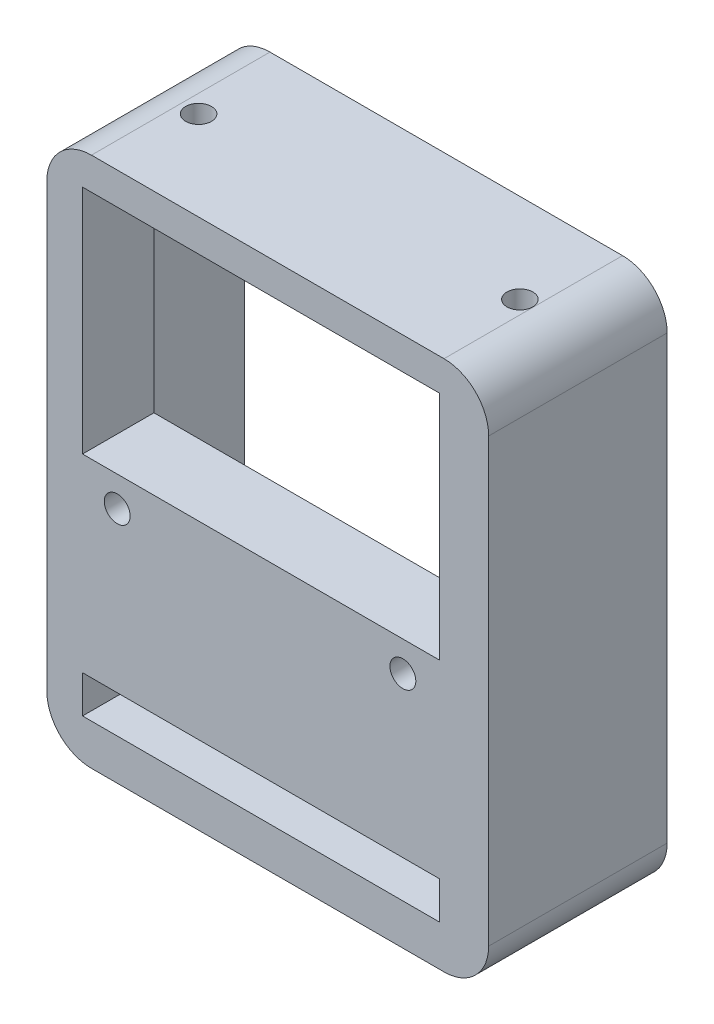
ISO-10303-21;
HEADER;
FILE_DESCRIPTION(('STEP AP214'),'2;1');
FILE_NAME('part.step','',(''),(''),'','','');
FILE_SCHEMA(('AUTOMOTIVE_DESIGN { 1 0 10303 214 1 1 1 1 }'));
ENDSEC;
DATA;
#1=APPLICATION_CONTEXT('core data for automotive mechanical design processes');
#2=APPLICATION_PROTOCOL_DEFINITION('international standard','automotive_design',2000,#1);
#3=PRODUCT_CONTEXT('',#1,'mechanical');
#4=PRODUCT('Part','Part','',(#3));
#5=PRODUCT_RELATED_PRODUCT_CATEGORY('part','',(#4));
#6=PRODUCT_DEFINITION_FORMATION('','',#4);
#7=PRODUCT_DEFINITION_CONTEXT('part definition',#1,'design');
#8=PRODUCT_DEFINITION('design','',#6,#7);
#9=PRODUCT_DEFINITION_SHAPE('','',#8);
#10=(LENGTH_UNIT() NAMED_UNIT(*) SI_UNIT(.MILLI.,.METRE.));
#11=(NAMED_UNIT(*) PLANE_ANGLE_UNIT() SI_UNIT($,.RADIAN.));
#12=(NAMED_UNIT(*) SI_UNIT($,.STERADIAN.) SOLID_ANGLE_UNIT());
#13=UNCERTAINTY_MEASURE_WITH_UNIT(LENGTH_MEASURE(1.E-05),#10,'distance_accuracy_value','');
#14=(GEOMETRIC_REPRESENTATION_CONTEXT(3) GLOBAL_UNCERTAINTY_ASSIGNED_CONTEXT((#13)) GLOBAL_UNIT_ASSIGNED_CONTEXT((#10,
#11,#12)) REPRESENTATION_CONTEXT('',''));
#15=CARTESIAN_POINT('',(0.,0.,0.));
#16=DIRECTION('',(0.,0.,1.));
#17=DIRECTION('',(1.,0.,0.));
#18=AXIS2_PLACEMENT_3D('',#15,#16,#17);
#19=CARTESIAN_POINT('',(19.75,-24.75,20.));
#20=DIRECTION('',(0.,0.,1.));
#21=DIRECTION('',(1.,0.,0.));
#22=AXIS2_PLACEMENT_3D('',#19,#20,#21);
#23=PLANE('',#22);
#24=CARTESIAN_POINT('',(-16.862,-3.116,20.));
#25=DIRECTION('',(0.,0.,-1.));
#26=DIRECTION('',(-1.,0.,0.));
#27=AXIS2_PLACEMENT_3D('',#24,#25,#26);
#28=CIRCLE('',#27,1.45);
#29=CARTESIAN_POINT('',(-18.312,-3.116,20.));
#30=VERTEX_POINT('',#29);
#31=EDGE_CURVE('E212',#30,#30,#28,.T.);
#32=ORIENTED_EDGE('',*,*,#31,.T.);
#33=EDGE_LOOP('',(#32));
#34=FACE_BOUND('',#33,.T.);
#35=CARTESIAN_POINT('',(15.138,-3.116,20.));
#36=DIRECTION('',(0.,0.,-1.));
#37=DIRECTION('',(-1.,0.,0.));
#38=AXIS2_PLACEMENT_3D('',#35,#36,#37);
#39=CIRCLE('',#38,1.45);
#40=CARTESIAN_POINT('',(13.688,-3.116,20.));
#41=VERTEX_POINT('',#40);
#42=EDGE_CURVE('E339',#41,#41,#39,.T.);
#43=ORIENTED_EDGE('',*,*,#42,.T.);
#44=EDGE_LOOP('',(#43));
#45=FACE_BOUND('',#44,.T.);
#46=CARTESIAN_POINT('',(19.75,-24.75,20.));
#47=DIRECTION('',(0.,0.,1.));
#48=DIRECTION('',(1.,0.,0.));
#49=AXIS2_PLACEMENT_3D('',#46,#47,#48);
#50=CIRCLE('',#49,4.99999999999999);
#51=CARTESIAN_POINT('',(19.75,-29.75,20.));
#52=VERTEX_POINT('',#51);
#53=CARTESIAN_POINT('',(24.75,-24.75,20.));
#54=VERTEX_POINT('',#53);
#55=EDGE_CURVE('E261',#52,#54,#50,.T.);
#56=ORIENTED_EDGE('',*,*,#55,.T.);
#57=DIRECTION('',(0.,1.,0.));
#58=VECTOR('',#57,1.);
#59=CARTESIAN_POINT('',(24.75,24.75,20.));
#60=LINE('',#59,#58);
#61=CARTESIAN_POINT('',(24.75,24.75,20.));
#62=VERTEX_POINT('',#61);
#63=EDGE_CURVE('E264',#54,#62,#60,.T.);
#64=ORIENTED_EDGE('',*,*,#63,.T.);
#65=CARTESIAN_POINT('',(19.75,24.75,20.));
#66=DIRECTION('',(0.,0.,1.));
#67=DIRECTION('',(-1.,0.,0.));
#68=AXIS2_PLACEMENT_3D('',#65,#66,#67);
#69=CIRCLE('',#68,4.99999999999999);
#70=CARTESIAN_POINT('',(19.75,29.75,20.));
#71=VERTEX_POINT('',#70);
#72=EDGE_CURVE('E267',#62,#71,#69,.T.);
#73=ORIENTED_EDGE('',*,*,#72,.T.);
#74=DIRECTION('',(-1.,0.,0.));
#75=VECTOR('',#74,1.);
#76=CARTESIAN_POINT('',(-19.75,29.75,20.));
#77=LINE('',#76,#75);
#78=CARTESIAN_POINT('',(-19.75,29.75,20.));
#79=VERTEX_POINT('',#78);
#80=EDGE_CURVE('E269',#71,#79,#77,.T.);
#81=ORIENTED_EDGE('',*,*,#80,.T.);
#82=CARTESIAN_POINT('',(-19.75,24.75,20.));
#83=DIRECTION('',(0.,0.,1.));
#84=DIRECTION('',(1.,0.,0.));
#85=AXIS2_PLACEMENT_3D('',#82,#83,#84);
#86=CIRCLE('',#85,4.99999999999999);
#87=CARTESIAN_POINT('',(-24.75,24.75,20.));
#88=VERTEX_POINT('',#87);
#89=EDGE_CURVE('E271',#79,#88,#86,.T.);
#90=ORIENTED_EDGE('',*,*,#89,.T.);
#91=DIRECTION('',(0.,-1.,0.));
#92=VECTOR('',#91,1.);
#93=CARTESIAN_POINT('',(-24.75,24.75,20.));
#94=LINE('',#93,#92);
#95=CARTESIAN_POINT('',(-24.75,-24.75,20.));
#96=VERTEX_POINT('',#95);
#97=EDGE_CURVE('E273',#88,#96,#94,.T.);
#98=ORIENTED_EDGE('',*,*,#97,.T.);
#99=CARTESIAN_POINT('',(-19.75,-24.75,20.));
#100=DIRECTION('',(0.,0.,1.));
#101=DIRECTION('',(1.,0.,0.));
#102=AXIS2_PLACEMENT_3D('',#99,#100,#101);
#103=CIRCLE('',#102,4.99999999999999);
#104=CARTESIAN_POINT('',(-19.75,-29.75,20.));
#105=VERTEX_POINT('',#104);
#106=EDGE_CURVE('E275',#96,#105,#103,.T.);
#107=ORIENTED_EDGE('',*,*,#106,.T.);
#108=DIRECTION('',(1.,0.,0.));
#109=VECTOR('',#108,1.);
#110=CARTESIAN_POINT('',(-19.75,-29.75,20.));
#111=LINE('',#110,#109);
#112=EDGE_CURVE('E277',#105,#52,#111,.T.);
#113=ORIENTED_EDGE('',*,*,#112,.T.);
#114=EDGE_LOOP('',(#56,#64,#73,#81,#90,#98,#107,#113));
#115=FACE_BOUND('',#114,.T.);
#116=DIRECTION('',(1.,0.,0.));
#117=VECTOR('',#116,1.);
#118=CARTESIAN_POINT('',(0.,-20.9650496624066,20.));
#119=LINE('',#118,#117);
#120=CARTESIAN_POINT('',(-20.75,-20.9650496624066,20.));
#121=VERTEX_POINT('',#120);
#122=CARTESIAN_POINT('',(19.25,-20.9650496624066,20.));
#123=VERTEX_POINT('',#122);
#124=EDGE_CURVE('E211',#121,#123,#119,.T.);
#125=ORIENTED_EDGE('',*,*,#124,.T.);
#126=DIRECTION('',(0.,-1.,0.));
#127=VECTOR('',#126,1.);
#128=CARTESIAN_POINT('',(19.25,0.,20.));
#129=LINE('',#128,#127);
#130=CARTESIAN_POINT('',(19.25,-25.1650496624066,20.));
#131=VERTEX_POINT('',#130);
#132=EDGE_CURVE('E64',#123,#131,#129,.T.);
#133=ORIENTED_EDGE('',*,*,#132,.T.);
#134=DIRECTION('',(1.,0.,0.));
#135=VECTOR('',#134,1.);
#136=CARTESIAN_POINT('',(0.,-25.1650496624066,20.));
#137=LINE('',#136,#135);
#138=CARTESIAN_POINT('',(-20.75,-25.1650496624066,20.));
#139=VERTEX_POINT('',#138);
#140=EDGE_CURVE('E218',#139,#131,#137,.T.);
#141=ORIENTED_EDGE('',*,*,#140,.F.);
#142=DIRECTION('',(0.,-1.,0.));
#143=VECTOR('',#142,1.);
#144=CARTESIAN_POINT('',(-20.75,0.,20.));
#145=LINE('',#144,#143);
#146=EDGE_CURVE('E215',#121,#139,#145,.T.);
#147=ORIENTED_EDGE('',*,*,#146,.F.);
#148=EDGE_LOOP('',(#125,#133,#141,#147));
#149=FACE_BOUND('',#148,.T.);
#150=DIRECTION('',(1.,0.,0.));
#151=VECTOR('',#150,1.);
#152=CARTESIAN_POINT('',(0.,26.15,20.));
#153=LINE('',#152,#151);
#154=CARTESIAN_POINT('',(-20.75,26.15,20.));
#155=VERTEX_POINT('',#154);
#156=CARTESIAN_POINT('',(19.25,26.15,20.));
#157=VERTEX_POINT('',#156);
#158=EDGE_CURVE('E195',#155,#157,#153,.T.);
#159=ORIENTED_EDGE('',*,*,#158,.T.);
#160=DIRECTION('',(0.,-1.,0.));
#161=VECTOR('',#160,1.);
#162=CARTESIAN_POINT('',(19.25,0.,20.));
#163=LINE('',#162,#161);
#164=CARTESIAN_POINT('',(19.25,0.249999999999993,20.));
#165=VERTEX_POINT('',#164);
#166=EDGE_CURVE('E56',#157,#165,#163,.T.);
#167=ORIENTED_EDGE('',*,*,#166,.T.);
#168=DIRECTION('',(1.,0.,0.));
#169=VECTOR('',#168,1.);
#170=CARTESIAN_POINT('',(0.,0.249999999999993,20.));
#171=LINE('',#170,#169);
#172=CARTESIAN_POINT('',(-20.75,0.249999999999993,20.));
#173=VERTEX_POINT('',#172);
#174=EDGE_CURVE('E200',#173,#165,#171,.T.);
#175=ORIENTED_EDGE('',*,*,#174,.F.);
#176=DIRECTION('',(0.,-1.,0.));
#177=VECTOR('',#176,1.);
#178=CARTESIAN_POINT('',(-20.75,0.,20.));
#179=LINE('',#178,#177);
#180=EDGE_CURVE('E185',#155,#173,#179,.T.);
#181=ORIENTED_EDGE('',*,*,#180,.F.);
#182=EDGE_LOOP('',(#159,#167,#175,#181));
#183=FACE_BOUND('',#182,.T.);
#184=ADVANCED_FACE('F39',(#34,#45,#115,#149,#183),#23,.T.);
#185=CARTESIAN_POINT('',(0.,0.,12.));
#186=DIRECTION('',(0.,0.,-1.));
#187=DIRECTION('',(-1.,0.,0.));
#188=AXIS2_PLACEMENT_3D('',#185,#186,#187);
#189=PLANE('',#188);
#190=CARTESIAN_POINT('',(-16.862,-3.116,12.));
#191=DIRECTION('',(0.,0.,-1.));
#192=DIRECTION('',(-1.,0.,0.));
#193=AXIS2_PLACEMENT_3D('',#190,#191,#192);
#194=CIRCLE('',#193,1.45);
#195=CARTESIAN_POINT('',(-18.312,-3.116,12.));
#196=VERTEX_POINT('',#195);
#197=EDGE_CURVE('E361',#196,#196,#194,.T.);
#198=ORIENTED_EDGE('',*,*,#197,.F.);
#199=EDGE_LOOP('',(#198));
#200=FACE_BOUND('',#199,.T.);
#201=CARTESIAN_POINT('',(15.138,-3.116,12.));
#202=DIRECTION('',(0.,0.,-1.));
#203=DIRECTION('',(-1.,0.,0.));
#204=AXIS2_PLACEMENT_3D('',#201,#202,#203);
#205=CIRCLE('',#204,1.45);
#206=CARTESIAN_POINT('',(13.688,-3.116,12.));
#207=VERTEX_POINT('',#206);
#208=EDGE_CURVE('E364',#207,#207,#205,.T.);
#209=ORIENTED_EDGE('',*,*,#208,.F.);
#210=EDGE_LOOP('',(#209));
#211=FACE_BOUND('',#210,.T.);
#212=DIRECTION('',(0.,1.,0.));
#213=VECTOR('',#212,1.);
#214=CARTESIAN_POINT('',(-22.6,27.6,12.));
#215=LINE('',#214,#213);
#216=CARTESIAN_POINT('',(-22.6,-27.6,12.));
#217=VERTEX_POINT('',#216);
#218=CARTESIAN_POINT('',(-22.6,27.6,12.));
#219=VERTEX_POINT('',#218);
#220=EDGE_CURVE('E229',#217,#219,#215,.T.);
#221=ORIENTED_EDGE('',*,*,#220,.T.);
#222=DIRECTION('',(1.,0.,0.));
#223=VECTOR('',#222,1.);
#224=CARTESIAN_POINT('',(22.6,27.6,12.));
#225=LINE('',#224,#223);
#226=CARTESIAN_POINT('',(22.6,27.6,12.));
#227=VERTEX_POINT('',#226);
#228=EDGE_CURVE('E232',#219,#227,#225,.T.);
#229=ORIENTED_EDGE('',*,*,#228,.T.);
#230=DIRECTION('',(0.,-1.,0.));
#231=VECTOR('',#230,1.);
#232=CARTESIAN_POINT('',(22.6,27.6,12.));
#233=LINE('',#232,#231);
#234=CARTESIAN_POINT('',(22.6,-27.6,12.));
#235=VERTEX_POINT('',#234);
#236=EDGE_CURVE('E236',#227,#235,#233,.T.);
#237=ORIENTED_EDGE('',*,*,#236,.T.);
#238=DIRECTION('',(-1.,0.,0.));
#239=VECTOR('',#238,1.);
#240=CARTESIAN_POINT('',(22.6,-27.6,12.));
#241=LINE('',#240,#239);
#242=EDGE_CURVE('E239',#235,#217,#241,.T.);
#243=ORIENTED_EDGE('',*,*,#242,.T.);
#244=EDGE_LOOP('',(#221,#229,#237,#243));
#245=FACE_BOUND('',#244,.T.);
#246=DIRECTION('',(-1.,0.,0.));
#247=VECTOR('',#246,1.);
#248=CARTESIAN_POINT('',(0.,-25.1650496624066,12.));
#249=LINE('',#248,#247);
#250=CARTESIAN_POINT('',(19.25,-25.1650496624066,12.));
#251=VERTEX_POINT('',#250);
#252=CARTESIAN_POINT('',(-20.75,-25.1650496624066,12.));
#253=VERTEX_POINT('',#252);
#254=EDGE_CURVE('E324',#251,#253,#249,.T.);
#255=ORIENTED_EDGE('',*,*,#254,.F.);
#256=DIRECTION('',(0.,1.,0.));
#257=VECTOR('',#256,1.);
#258=CARTESIAN_POINT('',(19.25,0.,12.));
#259=LINE('',#258,#257);
#260=CARTESIAN_POINT('',(19.25,-20.9650496624066,12.));
#261=VERTEX_POINT('',#260);
#262=EDGE_CURVE('E326',#251,#261,#259,.T.);
#263=ORIENTED_EDGE('',*,*,#262,.T.);
#264=DIRECTION('',(-1.,0.,0.));
#265=VECTOR('',#264,1.);
#266=CARTESIAN_POINT('',(0.,-20.9650496624066,12.));
#267=LINE('',#266,#265);
#268=CARTESIAN_POINT('',(-20.75,-20.9650496624066,12.));
#269=VERTEX_POINT('',#268);
#270=EDGE_CURVE('E318',#261,#269,#267,.T.);
#271=ORIENTED_EDGE('',*,*,#270,.T.);
#272=DIRECTION('',(0.,1.,0.));
#273=VECTOR('',#272,1.);
#274=CARTESIAN_POINT('',(-20.75,0.,12.));
#275=LINE('',#274,#273);
#276=EDGE_CURVE('E321',#253,#269,#275,.T.);
#277=ORIENTED_EDGE('',*,*,#276,.F.);
#278=EDGE_LOOP('',(#255,#263,#271,#277));
#279=FACE_BOUND('',#278,.T.);
#280=DIRECTION('',(-1.,0.,0.));
#281=VECTOR('',#280,1.);
#282=CARTESIAN_POINT('',(0.,0.249999999999993,12.));
#283=LINE('',#282,#281);
#284=CARTESIAN_POINT('',(19.25,0.249999999999993,12.));
#285=VERTEX_POINT('',#284);
#286=CARTESIAN_POINT('',(-20.75,0.249999999999993,12.));
#287=VERTEX_POINT('',#286);
#288=EDGE_CURVE('E48',#285,#287,#283,.T.);
#289=ORIENTED_EDGE('',*,*,#288,.F.);
#290=DIRECTION('',(0.,1.,0.));
#291=VECTOR('',#290,1.);
#292=CARTESIAN_POINT('',(19.25,0.,12.));
#293=LINE('',#292,#291);
#294=CARTESIAN_POINT('',(19.25,26.15,12.));
#295=VERTEX_POINT('',#294);
#296=EDGE_CURVE('E11',#285,#295,#293,.T.);
#297=ORIENTED_EDGE('',*,*,#296,.T.);
#298=DIRECTION('',(-1.,0.,0.));
#299=VECTOR('',#298,1.);
#300=CARTESIAN_POINT('',(0.,26.15,12.));
#301=LINE('',#300,#299);
#302=CARTESIAN_POINT('',(-20.75,26.15,12.));
#303=VERTEX_POINT('',#302);
#304=EDGE_CURVE('E329',#295,#303,#301,.T.);
#305=ORIENTED_EDGE('',*,*,#304,.T.);
#306=DIRECTION('',(0.,1.,0.));
#307=VECTOR('',#306,1.);
#308=CARTESIAN_POINT('',(-20.75,0.,12.));
#309=LINE('',#308,#307);
#310=EDGE_CURVE('E188',#287,#303,#309,.T.);
#311=ORIENTED_EDGE('',*,*,#310,.F.);
#312=EDGE_LOOP('',(#289,#297,#305,#311));
#313=FACE_BOUND('',#312,.T.);
#314=ADVANCED_FACE('F379',(#200,#211,#245,#279,#313),#189,.T.);
#315=CARTESIAN_POINT('',(19.75,-24.75,20.));
#316=DIRECTION('',(0.,0.,-1.));
#317=DIRECTION('',(-1.,0.,0.));
#318=AXIS2_PLACEMENT_3D('',#315,#316,#317);
#319=CYLINDRICAL_SURFACE('',#318,4.99999999999999);
#320=CARTESIAN_POINT('',(19.75,-24.75,0.));
#321=DIRECTION('',(0.,0.,1.));
#322=DIRECTION('',(1.,0.,0.));
#323=AXIS2_PLACEMENT_3D('',#320,#321,#322);
#324=CIRCLE('',#323,4.99999999999999);
#325=CARTESIAN_POINT('',(19.75,-29.75,0.));
#326=VERTEX_POINT('',#325);
#327=CARTESIAN_POINT('',(24.75,-24.75,0.));
#328=VERTEX_POINT('',#327);
#329=EDGE_CURVE('E254',#326,#328,#324,.T.);
#330=ORIENTED_EDGE('',*,*,#329,.T.);
#331=DIRECTION('',(0.,0.,-1.));
#332=VECTOR('',#331,1.);
#333=CARTESIAN_POINT('',(24.75,-24.75,20.));
#334=LINE('',#333,#332);
#335=EDGE_CURVE('E315',#54,#328,#334,.T.);
#336=ORIENTED_EDGE('',*,*,#335,.F.);
#337=ORIENTED_EDGE('',*,*,#55,.F.);
#338=DIRECTION('',(0.,0.,-1.));
#339=VECTOR('',#338,1.);
#340=CARTESIAN_POINT('',(19.75,-29.75,20.));
#341=LINE('',#340,#339);
#342=EDGE_CURVE('E279',#52,#326,#341,.T.);
#343=ORIENTED_EDGE('',*,*,#342,.T.);
#344=EDGE_LOOP('',(#330,#336,#337,#343));
#345=FACE_BOUND('',#344,.T.);
#346=ADVANCED_FACE('F41',(#345),#319,.T.);
#347=CARTESIAN_POINT('',(24.75,24.75,20.));
#348=DIRECTION('',(-1.,0.,0.));
#349=DIRECTION('',(0.,0.,1.));
#350=AXIS2_PLACEMENT_3D('',#347,#348,#349);
#351=PLANE('',#350);
#352=DIRECTION('',(0.,1.,0.));
#353=VECTOR('',#352,1.);
#354=CARTESIAN_POINT('',(24.75,24.75,0.));
#355=LINE('',#354,#353);
#356=CARTESIAN_POINT('',(24.75,24.75,0.));
#357=VERTEX_POINT('',#356);
#358=EDGE_CURVE('E282',#328,#357,#355,.T.);
#359=ORIENTED_EDGE('',*,*,#358,.T.);
#360=DIRECTION('',(0.,0.,-1.));
#361=VECTOR('',#360,1.);
#362=CARTESIAN_POINT('',(24.75,24.75,20.));
#363=LINE('',#362,#361);
#364=EDGE_CURVE('E312',#62,#357,#363,.T.);
#365=ORIENTED_EDGE('',*,*,#364,.F.);
#366=ORIENTED_EDGE('',*,*,#63,.F.);
#367=ORIENTED_EDGE('',*,*,#335,.T.);
#368=EDGE_LOOP('',(#359,#365,#366,#367));
#369=FACE_BOUND('',#368,.T.);
#370=ADVANCED_FACE('F442',(#369),#351,.F.);
#371=CARTESIAN_POINT('',(19.75,24.75,20.));
#372=DIRECTION('',(0.,0.,-1.));
#373=DIRECTION('',(-1.,0.,0.));
#374=AXIS2_PLACEMENT_3D('',#371,#372,#373);
#375=CYLINDRICAL_SURFACE('',#374,4.99999999999999);
#376=CARTESIAN_POINT('',(19.75,24.75,0.));
#377=DIRECTION('',(0.,0.,1.));
#378=DIRECTION('',(-1.,0.,0.));
#379=AXIS2_PLACEMENT_3D('',#376,#377,#378);
#380=CIRCLE('',#379,4.99999999999999);
#381=CARTESIAN_POINT('',(19.75,29.75,0.));
#382=VERTEX_POINT('',#381);
#383=EDGE_CURVE('E284',#357,#382,#380,.T.);
#384=ORIENTED_EDGE('',*,*,#383,.T.);
#385=DIRECTION('',(0.,0.,-1.));
#386=VECTOR('',#385,1.);
#387=CARTESIAN_POINT('',(19.75,29.75,20.));
#388=LINE('',#387,#386);
#389=EDGE_CURVE('E309',#71,#382,#388,.T.);
#390=ORIENTED_EDGE('',*,*,#389,.F.);
#391=ORIENTED_EDGE('',*,*,#72,.F.);
#392=ORIENTED_EDGE('',*,*,#364,.T.);
#393=EDGE_LOOP('',(#384,#390,#391,#392));
#394=FACE_BOUND('',#393,.T.);
#395=ADVANCED_FACE('F439',(#394),#375,.T.);
#396=CARTESIAN_POINT('',(-19.75,29.75,20.));
#397=DIRECTION('',(0.,-1.,0.));
#398=DIRECTION('',(0.,0.,-1.));
#399=AXIS2_PLACEMENT_3D('',#396,#397,#398);
#400=PLANE('',#399);
#401=CARTESIAN_POINT('',(-17.75,29.75,10.));
#402=DIRECTION('',(0.,1.,0.));
#403=DIRECTION('',(0.,0.,1.));
#404=AXIS2_PLACEMENT_3D('',#401,#402,#403);
#405=CIRCLE('',#404,1.45);
#406=CARTESIAN_POINT('',(-17.75,29.75,11.45));
#407=VERTEX_POINT('',#406);
#408=EDGE_CURVE('E337',#407,#407,#405,.T.);
#409=ORIENTED_EDGE('',*,*,#408,.F.);
#410=EDGE_LOOP('',(#409));
#411=FACE_BOUND('',#410,.T.);
#412=CARTESIAN_POINT('',(18.25,29.75,10.));
#413=DIRECTION('',(0.,1.,0.));
#414=DIRECTION('',(0.,0.,1.));
#415=AXIS2_PLACEMENT_3D('',#412,#413,#414);
#416=CIRCLE('',#415,1.45);
#417=CARTESIAN_POINT('',(18.25,29.75,11.45));
#418=VERTEX_POINT('',#417);
#419=EDGE_CURVE('E346',#418,#418,#416,.T.);
#420=ORIENTED_EDGE('',*,*,#419,.F.);
#421=EDGE_LOOP('',(#420));
#422=FACE_BOUND('',#421,.T.);
#423=DIRECTION('',(-1.,0.,0.));
#424=VECTOR('',#423,1.);
#425=CARTESIAN_POINT('',(-19.75,29.75,0.));
#426=LINE('',#425,#424);
#427=CARTESIAN_POINT('',(-19.75,29.75,0.));
#428=VERTEX_POINT('',#427);
#429=EDGE_CURVE('E286',#382,#428,#426,.T.);
#430=ORIENTED_EDGE('',*,*,#429,.T.);
#431=DIRECTION('',(0.,0.,-1.));
#432=VECTOR('',#431,1.);
#433=CARTESIAN_POINT('',(-19.75,29.75,20.));
#434=LINE('',#433,#432);
#435=EDGE_CURVE('E306',#79,#428,#434,.T.);
#436=ORIENTED_EDGE('',*,*,#435,.F.);
#437=ORIENTED_EDGE('',*,*,#80,.F.);
#438=ORIENTED_EDGE('',*,*,#389,.T.);
#439=EDGE_LOOP('',(#430,#436,#437,#438));
#440=FACE_BOUND('',#439,.T.);
#441=ADVANCED_FACE('F435',(#411,#422,#440),#400,.F.);
#442=CARTESIAN_POINT('',(-19.75,24.75,20.));
#443=DIRECTION('',(0.,0.,-1.));
#444=DIRECTION('',(-1.,0.,0.));
#445=AXIS2_PLACEMENT_3D('',#442,#443,#444);
#446=CYLINDRICAL_SURFACE('',#445,4.99999999999999);
#447=CARTESIAN_POINT('',(-19.75,24.75,0.));
#448=DIRECTION('',(0.,0.,1.));
#449=DIRECTION('',(1.,0.,0.));
#450=AXIS2_PLACEMENT_3D('',#447,#448,#449);
#451=CIRCLE('',#450,4.99999999999999);
#452=CARTESIAN_POINT('',(-24.75,24.75,0.));
#453=VERTEX_POINT('',#452);
#454=EDGE_CURVE('E288',#428,#453,#451,.T.);
#455=ORIENTED_EDGE('',*,*,#454,.T.);
#456=DIRECTION('',(0.,0.,-1.));
#457=VECTOR('',#456,1.);
#458=CARTESIAN_POINT('',(-24.75,24.75,20.));
#459=LINE('',#458,#457);
#460=EDGE_CURVE('E303',#88,#453,#459,.T.);
#461=ORIENTED_EDGE('',*,*,#460,.F.);
#462=ORIENTED_EDGE('',*,*,#89,.F.);
#463=ORIENTED_EDGE('',*,*,#435,.T.);
#464=EDGE_LOOP('',(#455,#461,#462,#463));
#465=FACE_BOUND('',#464,.T.);
#466=ADVANCED_FACE('F431',(#465),#446,.T.);
#467=CARTESIAN_POINT('',(-24.75,24.75,20.));
#468=DIRECTION('',(1.,0.,0.));
#469=DIRECTION('',(0.,0.,-1.));
#470=AXIS2_PLACEMENT_3D('',#467,#468,#469);
#471=PLANE('',#470);
#472=DIRECTION('',(0.,-1.,0.));
#473=VECTOR('',#472,1.);
#474=CARTESIAN_POINT('',(-24.75,24.75,0.));
#475=LINE('',#474,#473);
#476=CARTESIAN_POINT('',(-24.75,-24.75,0.));
#477=VERTEX_POINT('',#476);
#478=EDGE_CURVE('E290',#453,#477,#475,.T.);
#479=ORIENTED_EDGE('',*,*,#478,.T.);
#480=DIRECTION('',(0.,0.,-1.));
#481=VECTOR('',#480,1.);
#482=CARTESIAN_POINT('',(-24.75,-24.75,20.));
#483=LINE('',#482,#481);
#484=EDGE_CURVE('E300',#96,#477,#483,.T.);
#485=ORIENTED_EDGE('',*,*,#484,.F.);
#486=ORIENTED_EDGE('',*,*,#97,.F.);
#487=ORIENTED_EDGE('',*,*,#460,.T.);
#488=EDGE_LOOP('',(#479,#485,#486,#487));
#489=FACE_BOUND('',#488,.T.);
#490=ADVANCED_FACE('F427',(#489),#471,.F.);
#491=CARTESIAN_POINT('',(-19.75,-24.75,20.));
#492=DIRECTION('',(0.,0.,-1.));
#493=DIRECTION('',(-1.,0.,0.));
#494=AXIS2_PLACEMENT_3D('',#491,#492,#493);
#495=CYLINDRICAL_SURFACE('',#494,4.99999999999999);
#496=CARTESIAN_POINT('',(-19.75,-24.75,0.));
#497=DIRECTION('',(0.,0.,1.));
#498=DIRECTION('',(1.,0.,0.));
#499=AXIS2_PLACEMENT_3D('',#496,#497,#498);
#500=CIRCLE('',#499,4.99999999999999);
#501=CARTESIAN_POINT('',(-19.75,-29.75,0.));
#502=VERTEX_POINT('',#501);
#503=EDGE_CURVE('E292',#477,#502,#500,.T.);
#504=ORIENTED_EDGE('',*,*,#503,.T.);
#505=DIRECTION('',(0.,0.,-1.));
#506=VECTOR('',#505,1.);
#507=CARTESIAN_POINT('',(-19.75,-29.75,20.));
#508=LINE('',#507,#506);
#509=EDGE_CURVE('E297',#105,#502,#508,.T.);
#510=ORIENTED_EDGE('',*,*,#509,.F.);
#511=ORIENTED_EDGE('',*,*,#106,.F.);
#512=ORIENTED_EDGE('',*,*,#484,.T.);
#513=EDGE_LOOP('',(#504,#510,#511,#512));
#514=FACE_BOUND('',#513,.T.);
#515=ADVANCED_FACE('F423',(#514),#495,.T.);
#516=CARTESIAN_POINT('',(-19.75,-29.75,20.));
#517=DIRECTION('',(0.,1.,0.));
#518=DIRECTION('',(0.,0.,1.));
#519=AXIS2_PLACEMENT_3D('',#516,#517,#518);
#520=PLANE('',#519);
#521=CARTESIAN_POINT('',(-10.,-29.75,10.));
#522=DIRECTION('',(0.,-1.,0.));
#523=DIRECTION('',(0.,0.,-1.));
#524=AXIS2_PLACEMENT_3D('',#521,#522,#523);
#525=CIRCLE('',#524,1.45);
#526=CARTESIAN_POINT('',(-10.,-29.75,8.55));
#527=VERTEX_POINT('',#526);
#528=EDGE_CURVE('E342',#527,#527,#525,.T.);
#529=ORIENTED_EDGE('',*,*,#528,.F.);
#530=EDGE_LOOP('',(#529));
#531=FACE_BOUND('',#530,.T.);
#532=CARTESIAN_POINT('',(10.,-29.75,10.));
#533=DIRECTION('',(0.,-1.,0.));
#534=DIRECTION('',(0.,0.,-1.));
#535=AXIS2_PLACEMENT_3D('',#532,#533,#534);
#536=CIRCLE('',#535,1.45);
#537=CARTESIAN_POINT('',(10.,-29.75,8.55));
#538=VERTEX_POINT('',#537);
#539=EDGE_CURVE('E348',#538,#538,#536,.T.);
#540=ORIENTED_EDGE('',*,*,#539,.F.);
#541=EDGE_LOOP('',(#540));
#542=FACE_BOUND('',#541,.T.);
#543=DIRECTION('',(1.,0.,0.));
#544=VECTOR('',#543,1.);
#545=CARTESIAN_POINT('',(-19.75,-29.75,0.));
#546=LINE('',#545,#544);
#547=EDGE_CURVE('E265',#502,#326,#546,.T.);
#548=ORIENTED_EDGE('',*,*,#547,.T.);
#549=ORIENTED_EDGE('',*,*,#342,.F.);
#550=ORIENTED_EDGE('',*,*,#112,.F.);
#551=ORIENTED_EDGE('',*,*,#509,.T.);
#552=EDGE_LOOP('',(#548,#549,#550,#551));
#553=FACE_BOUND('',#552,.T.);
#554=ADVANCED_FACE('F419',(#531,#542,#553),#520,.F.);
#555=CARTESIAN_POINT('',(19.75,-24.75,0.));
#556=DIRECTION('',(0.,0.,1.));
#557=DIRECTION('',(1.,0.,0.));
#558=AXIS2_PLACEMENT_3D('',#555,#556,#557);
#559=PLANE('',#558);
#560=DIRECTION('',(1.,0.,0.));
#561=VECTOR('',#560,1.);
#562=CARTESIAN_POINT('',(22.6,27.6,0.));
#563=LINE('',#562,#561);
#564=CARTESIAN_POINT('',(-22.6,27.6,0.));
#565=VERTEX_POINT('',#564);
#566=CARTESIAN_POINT('',(22.6,27.6,0.));
#567=VERTEX_POINT('',#566);
#568=EDGE_CURVE('E244',#565,#567,#563,.T.);
#569=ORIENTED_EDGE('',*,*,#568,.F.);
#570=DIRECTION('',(0.,1.,0.));
#571=VECTOR('',#570,1.);
#572=CARTESIAN_POINT('',(-22.6,27.6,0.));
#573=LINE('',#572,#571);
#574=CARTESIAN_POINT('',(-22.6,-27.6,0.));
#575=VERTEX_POINT('',#574);
#576=EDGE_CURVE('E207',#575,#565,#573,.T.);
#577=ORIENTED_EDGE('',*,*,#576,.F.);
#578=DIRECTION('',(-1.,0.,0.));
#579=VECTOR('',#578,1.);
#580=CARTESIAN_POINT('',(22.6,-27.6,0.));
#581=LINE('',#580,#579);
#582=CARTESIAN_POINT('',(22.6,-27.6,0.));
#583=VERTEX_POINT('',#582);
#584=EDGE_CURVE('E233',#583,#575,#581,.T.);
#585=ORIENTED_EDGE('',*,*,#584,.F.);
#586=DIRECTION('',(0.,-1.,0.));
#587=VECTOR('',#586,1.);
#588=CARTESIAN_POINT('',(22.6,27.6,0.));
#589=LINE('',#588,#587);
#590=EDGE_CURVE('E247',#567,#583,#589,.T.);
#591=ORIENTED_EDGE('',*,*,#590,.F.);
#592=EDGE_LOOP('',(#569,#577,#585,#591));
#593=FACE_BOUND('',#592,.T.);
#594=ORIENTED_EDGE('',*,*,#329,.F.);
#595=ORIENTED_EDGE('',*,*,#547,.F.);
#596=ORIENTED_EDGE('',*,*,#503,.F.);
#597=ORIENTED_EDGE('',*,*,#478,.F.);
#598=ORIENTED_EDGE('',*,*,#454,.F.);
#599=ORIENTED_EDGE('',*,*,#429,.F.);
#600=ORIENTED_EDGE('',*,*,#383,.F.);
#601=ORIENTED_EDGE('',*,*,#358,.F.);
#602=EDGE_LOOP('',(#594,#595,#596,#597,#598,#599,#600,#601));
#603=FACE_BOUND('',#602,.T.);
#604=ADVANCED_FACE('F416',(#593,#603),#559,.F.);
#605=CARTESIAN_POINT('',(-22.6,27.6,12.));
#606=DIRECTION('',(-1.,0.,0.));
#607=DIRECTION('',(0.,0.,1.));
#608=AXIS2_PLACEMENT_3D('',#605,#606,#607);
#609=PLANE('',#608);
#610=ORIENTED_EDGE('',*,*,#576,.T.);
#611=DIRECTION('',(0.,0.,-1.));
#612=VECTOR('',#611,1.);
#613=CARTESIAN_POINT('',(-22.6,27.6,12.));
#614=LINE('',#613,#612);
#615=EDGE_CURVE('E242',#219,#565,#614,.T.);
#616=ORIENTED_EDGE('',*,*,#615,.F.);
#617=ORIENTED_EDGE('',*,*,#220,.F.);
#618=DIRECTION('',(0.,0.,-1.));
#619=VECTOR('',#618,1.);
#620=CARTESIAN_POINT('',(-22.6,-27.6,12.));
#621=LINE('',#620,#619);
#622=EDGE_CURVE('E252',#217,#575,#621,.T.);
#623=ORIENTED_EDGE('',*,*,#622,.T.);
#624=EDGE_LOOP('',(#610,#616,#617,#623));
#625=FACE_BOUND('',#624,.T.);
#626=ADVANCED_FACE('F414',(#625),#609,.F.);
#627=CARTESIAN_POINT('',(22.6,-27.6,12.));
#628=DIRECTION('',(0.,-1.,0.));
#629=DIRECTION('',(0.,0.,-1.));
#630=AXIS2_PLACEMENT_3D('',#627,#628,#629);
#631=PLANE('',#630);
#632=CARTESIAN_POINT('',(-10.,-27.6,10.));
#633=DIRECTION('',(0.,-1.,0.));
#634=DIRECTION('',(0.,0.,-1.));
#635=AXIS2_PLACEMENT_3D('',#632,#633,#634);
#636=CIRCLE('',#635,1.45);
#637=CARTESIAN_POINT('',(-10.,-27.6,8.55));
#638=VERTEX_POINT('',#637);
#639=EDGE_CURVE('E43',#638,#638,#636,.T.);
#640=ORIENTED_EDGE('',*,*,#639,.T.);
#641=EDGE_LOOP('',(#640));
#642=FACE_BOUND('',#641,.T.);
#643=CARTESIAN_POINT('',(10.,-27.6,10.));
#644=DIRECTION('',(0.,-1.,0.));
#645=DIRECTION('',(0.,0.,-1.));
#646=AXIS2_PLACEMENT_3D('',#643,#644,#645);
#647=CIRCLE('',#646,1.45);
#648=CARTESIAN_POINT('',(10.,-27.6,8.55));
#649=VERTEX_POINT('',#648);
#650=EDGE_CURVE('E340',#649,#649,#647,.T.);
#651=ORIENTED_EDGE('',*,*,#650,.T.);
#652=EDGE_LOOP('',(#651));
#653=FACE_BOUND('',#652,.T.);
#654=ORIENTED_EDGE('',*,*,#584,.T.);
#655=ORIENTED_EDGE('',*,*,#622,.F.);
#656=ORIENTED_EDGE('',*,*,#242,.F.);
#657=DIRECTION('',(0.,0.,-1.));
#658=VECTOR('',#657,1.);
#659=CARTESIAN_POINT('',(22.6,-27.6,12.));
#660=LINE('',#659,#658);
#661=EDGE_CURVE('E255',#235,#583,#660,.T.);
#662=ORIENTED_EDGE('',*,*,#661,.T.);
#663=EDGE_LOOP('',(#654,#655,#656,#662));
#664=FACE_BOUND('',#663,.T.);
#665=ADVANCED_FACE('F494',(#642,#653,#664),#631,.F.);
#666=CARTESIAN_POINT('',(22.6,27.6,12.));
#667=DIRECTION('',(1.,0.,0.));
#668=DIRECTION('',(0.,0.,-1.));
#669=AXIS2_PLACEMENT_3D('',#666,#667,#668);
#670=PLANE('',#669);
#671=ORIENTED_EDGE('',*,*,#590,.T.);
#672=ORIENTED_EDGE('',*,*,#661,.F.);
#673=ORIENTED_EDGE('',*,*,#236,.F.);
#674=DIRECTION('',(0.,0.,-1.));
#675=VECTOR('',#674,1.);
#676=CARTESIAN_POINT('',(22.6,27.6,12.));
#677=LINE('',#676,#675);
#678=EDGE_CURVE('E257',#227,#567,#677,.T.);
#679=ORIENTED_EDGE('',*,*,#678,.T.);
#680=EDGE_LOOP('',(#671,#672,#673,#679));
#681=FACE_BOUND('',#680,.T.);
#682=ADVANCED_FACE('F497',(#681),#670,.F.);
#683=CARTESIAN_POINT('',(22.6,27.6,12.));
#684=DIRECTION('',(0.,1.,0.));
#685=DIRECTION('',(0.,0.,1.));
#686=AXIS2_PLACEMENT_3D('',#683,#684,#685);
#687=PLANE('',#686);
#688=CARTESIAN_POINT('',(-17.75,27.6,10.));
#689=DIRECTION('',(0.,1.,0.));
#690=DIRECTION('',(0.,0.,1.));
#691=AXIS2_PLACEMENT_3D('',#688,#689,#690);
#692=CIRCLE('',#691,1.45);
#693=CARTESIAN_POINT('',(-17.75,27.6,11.45));
#694=VERTEX_POINT('',#693);
#695=EDGE_CURVE('E336',#694,#694,#692,.T.);
#696=ORIENTED_EDGE('',*,*,#695,.T.);
#697=EDGE_LOOP('',(#696));
#698=FACE_BOUND('',#697,.T.);
#699=CARTESIAN_POINT('',(18.25,27.6,10.));
#700=DIRECTION('',(0.,1.,0.));
#701=DIRECTION('',(0.,0.,1.));
#702=AXIS2_PLACEMENT_3D('',#699,#700,#701);
#703=CIRCLE('',#702,1.45);
#704=CARTESIAN_POINT('',(18.25,27.6,11.45));
#705=VERTEX_POINT('',#704);
#706=EDGE_CURVE('E333',#705,#705,#703,.T.);
#707=ORIENTED_EDGE('',*,*,#706,.T.);
#708=EDGE_LOOP('',(#707));
#709=FACE_BOUND('',#708,.T.);
#710=ORIENTED_EDGE('',*,*,#568,.T.);
#711=ORIENTED_EDGE('',*,*,#678,.F.);
#712=ORIENTED_EDGE('',*,*,#228,.F.);
#713=ORIENTED_EDGE('',*,*,#615,.T.);
#714=EDGE_LOOP('',(#710,#711,#712,#713));
#715=FACE_BOUND('',#714,.T.);
#716=ADVANCED_FACE('F491',(#698,#709,#715),#687,.F.);
#717=CARTESIAN_POINT('',(19.25,0.,0.));
#718=DIRECTION('',(-1.,0.,0.));
#719=DIRECTION('',(0.,0.,1.));
#720=AXIS2_PLACEMENT_3D('',#717,#718,#719);
#721=PLANE('',#720);
#722=DIRECTION('',(0.,0.,1.));
#723=VECTOR('',#722,1.);
#724=CARTESIAN_POINT('',(19.25,-25.1650496624066,0.));
#725=LINE('',#724,#723);
#726=EDGE_CURVE('E222',#251,#131,#725,.T.);
#727=ORIENTED_EDGE('',*,*,#726,.T.);
#728=ORIENTED_EDGE('',*,*,#132,.F.);
#729=DIRECTION('',(0.,0.,1.));
#730=VECTOR('',#729,1.);
#731=CARTESIAN_POINT('',(19.25,-20.9650496624066,0.));
#732=LINE('',#731,#730);
#733=EDGE_CURVE('E221',#261,#123,#732,.T.);
#734=ORIENTED_EDGE('',*,*,#733,.F.);
#735=ORIENTED_EDGE('',*,*,#262,.F.);
#736=EDGE_LOOP('',(#727,#728,#734,#735));
#737=FACE_BOUND('',#736,.T.);
#738=ADVANCED_FACE('F479',(#737),#721,.T.);
#739=CARTESIAN_POINT('',(0.,-25.1650496624066,0.));
#740=DIRECTION('',(0.,-1.,0.));
#741=DIRECTION('',(0.,0.,-1.));
#742=AXIS2_PLACEMENT_3D('',#739,#740,#741);
#743=PLANE('',#742);
#744=ORIENTED_EDGE('',*,*,#254,.T.);
#745=DIRECTION('',(0.,0.,1.));
#746=VECTOR('',#745,1.);
#747=CARTESIAN_POINT('',(-20.75,-25.1650496624066,0.));
#748=LINE('',#747,#746);
#749=EDGE_CURVE('E224',#253,#139,#748,.T.);
#750=ORIENTED_EDGE('',*,*,#749,.T.);
#751=ORIENTED_EDGE('',*,*,#140,.T.);
#752=ORIENTED_EDGE('',*,*,#726,.F.);
#753=EDGE_LOOP('',(#744,#750,#751,#752));
#754=FACE_BOUND('',#753,.T.);
#755=ADVANCED_FACE('F484',(#754),#743,.F.);
#756=CARTESIAN_POINT('',(-20.75,0.,0.));
#757=DIRECTION('',(-1.,0.,0.));
#758=DIRECTION('',(0.,-1.,0.));
#759=AXIS2_PLACEMENT_3D('',#756,#757,#758);
#760=PLANE('',#759);
#761=ORIENTED_EDGE('',*,*,#276,.T.);
#762=DIRECTION('',(0.,0.,1.));
#763=VECTOR('',#762,1.);
#764=CARTESIAN_POINT('',(-20.75,-20.9650496624066,0.));
#765=LINE('',#764,#763);
#766=EDGE_CURVE('E226',#269,#121,#765,.T.);
#767=ORIENTED_EDGE('',*,*,#766,.T.);
#768=ORIENTED_EDGE('',*,*,#146,.T.);
#769=ORIENTED_EDGE('',*,*,#749,.F.);
#770=EDGE_LOOP('',(#761,#767,#768,#769));
#771=FACE_BOUND('',#770,.T.);
#772=ADVANCED_FACE('F402',(#771),#760,.F.);
#773=CARTESIAN_POINT('',(0.,-20.9650496624066,0.));
#774=DIRECTION('',(0.,-1.,0.));
#775=DIRECTION('',(0.,0.,-1.));
#776=AXIS2_PLACEMENT_3D('',#773,#774,#775);
#777=PLANE('',#776);
#778=ORIENTED_EDGE('',*,*,#733,.T.);
#779=ORIENTED_EDGE('',*,*,#124,.F.);
#780=ORIENTED_EDGE('',*,*,#766,.F.);
#781=ORIENTED_EDGE('',*,*,#270,.F.);
#782=EDGE_LOOP('',(#778,#779,#780,#781));
#783=FACE_BOUND('',#782,.T.);
#784=ADVANCED_FACE('F395',(#783),#777,.T.);
#785=CARTESIAN_POINT('',(19.25,0.,0.));
#786=DIRECTION('',(-1.,0.,0.));
#787=DIRECTION('',(0.,-1.,0.));
#788=AXIS2_PLACEMENT_3D('',#785,#786,#787);
#789=PLANE('',#788);
#790=DIRECTION('',(0.,0.,1.));
#791=VECTOR('',#790,1.);
#792=CARTESIAN_POINT('',(19.25,0.249999999999993,0.));
#793=LINE('',#792,#791);
#794=EDGE_CURVE('E205',#285,#165,#793,.T.);
#795=ORIENTED_EDGE('',*,*,#794,.T.);
#796=ORIENTED_EDGE('',*,*,#166,.F.);
#797=DIRECTION('',(0.,0.,1.));
#798=VECTOR('',#797,1.);
#799=CARTESIAN_POINT('',(19.25,26.15,0.));
#800=LINE('',#799,#798);
#801=EDGE_CURVE('E192',#295,#157,#800,.T.);
#802=ORIENTED_EDGE('',*,*,#801,.F.);
#803=ORIENTED_EDGE('',*,*,#296,.F.);
#804=EDGE_LOOP('',(#795,#796,#802,#803));
#805=FACE_BOUND('',#804,.T.);
#806=ADVANCED_FACE('F393',(#805),#789,.T.);
#807=CARTESIAN_POINT('',(0.,0.249999999999993,0.));
#808=DIRECTION('',(0.,-1.,0.));
#809=DIRECTION('',(0.,0.,-1.));
#810=AXIS2_PLACEMENT_3D('',#807,#808,#809);
#811=PLANE('',#810);
#812=ORIENTED_EDGE('',*,*,#288,.T.);
#813=DIRECTION('',(0.,0.,1.));
#814=VECTOR('',#813,1.);
#815=CARTESIAN_POINT('',(-20.75,0.249999999999993,0.));
#816=LINE('',#815,#814);
#817=EDGE_CURVE('E191',#287,#173,#816,.T.);
#818=ORIENTED_EDGE('',*,*,#817,.T.);
#819=ORIENTED_EDGE('',*,*,#174,.T.);
#820=ORIENTED_EDGE('',*,*,#794,.F.);
#821=EDGE_LOOP('',(#812,#818,#819,#820));
#822=FACE_BOUND('',#821,.T.);
#823=ADVANCED_FACE('F392',(#822),#811,.F.);
#824=CARTESIAN_POINT('',(-20.75,0.,0.));
#825=DIRECTION('',(-1.,0.,0.));
#826=DIRECTION('',(0.,-1.,0.));
#827=AXIS2_PLACEMENT_3D('',#824,#825,#826);
#828=PLANE('',#827);
#829=ORIENTED_EDGE('',*,*,#310,.T.);
#830=DIRECTION('',(0.,0.,1.));
#831=VECTOR('',#830,1.);
#832=CARTESIAN_POINT('',(-20.75,26.15,0.));
#833=LINE('',#832,#831);
#834=EDGE_CURVE('E180',#303,#155,#833,.T.);
#835=ORIENTED_EDGE('',*,*,#834,.T.);
#836=ORIENTED_EDGE('',*,*,#180,.T.);
#837=ORIENTED_EDGE('',*,*,#817,.F.);
#838=EDGE_LOOP('',(#829,#835,#836,#837));
#839=FACE_BOUND('',#838,.T.);
#840=ADVANCED_FACE('F182',(#839),#828,.F.);
#841=CARTESIAN_POINT('',(0.,26.15,0.));
#842=DIRECTION('',(0.,-1.,0.));
#843=DIRECTION('',(0.,0.,-1.));
#844=AXIS2_PLACEMENT_3D('',#841,#842,#843);
#845=PLANE('',#844);
#846=ORIENTED_EDGE('',*,*,#801,.T.);
#847=ORIENTED_EDGE('',*,*,#158,.F.);
#848=ORIENTED_EDGE('',*,*,#834,.F.);
#849=ORIENTED_EDGE('',*,*,#304,.F.);
#850=EDGE_LOOP('',(#846,#847,#848,#849));
#851=FACE_BOUND('',#850,.T.);
#852=ADVANCED_FACE('F196',(#851),#845,.T.);
#853=CARTESIAN_POINT('',(15.138,-3.116,20.));
#854=DIRECTION('',(0.,0.,-1.));
#855=DIRECTION('',(-1.,0.,0.));
#856=AXIS2_PLACEMENT_3D('',#853,#854,#855);
#857=CYLINDRICAL_SURFACE('',#856,1.45);
#858=ORIENTED_EDGE('',*,*,#42,.F.);
#859=EDGE_LOOP('',(#858));
#860=FACE_BOUND('',#859,.T.);
#861=ORIENTED_EDGE('',*,*,#208,.T.);
#862=EDGE_LOOP('',(#861));
#863=FACE_BOUND('',#862,.T.);
#864=ADVANCED_FACE('F372',(#860,#863),#857,.F.);
#865=CARTESIAN_POINT('',(-16.862,-3.116,20.));
#866=DIRECTION('',(0.,0.,-1.));
#867=DIRECTION('',(-1.,0.,0.));
#868=AXIS2_PLACEMENT_3D('',#865,#866,#867);
#869=CYLINDRICAL_SURFACE('',#868,1.45);
#870=ORIENTED_EDGE('',*,*,#31,.F.);
#871=EDGE_LOOP('',(#870));
#872=FACE_BOUND('',#871,.T.);
#873=ORIENTED_EDGE('',*,*,#197,.T.);
#874=EDGE_LOOP('',(#873));
#875=FACE_BOUND('',#874,.T.);
#876=ADVANCED_FACE('F375',(#872,#875),#869,.F.);
#877=CARTESIAN_POINT('',(18.25,23.75,10.));
#878=DIRECTION('',(0.,1.,0.));
#879=DIRECTION('',(0.,0.,1.));
#880=AXIS2_PLACEMENT_3D('',#877,#878,#879);
#881=CYLINDRICAL_SURFACE('',#880,1.45);
#882=ORIENTED_EDGE('',*,*,#419,.T.);
#883=EDGE_LOOP('',(#882));
#884=FACE_BOUND('',#883,.T.);
#885=ORIENTED_EDGE('',*,*,#706,.F.);
#886=EDGE_LOOP('',(#885));
#887=FACE_BOUND('',#886,.T.);
#888=ADVANCED_FACE('F618',(#884,#887),#881,.F.);
#889=CARTESIAN_POINT('',(-17.75,23.75,10.));
#890=DIRECTION('',(0.,1.,0.));
#891=DIRECTION('',(0.,0.,1.));
#892=AXIS2_PLACEMENT_3D('',#889,#890,#891);
#893=CYLINDRICAL_SURFACE('',#892,1.45);
#894=ORIENTED_EDGE('',*,*,#408,.T.);
#895=EDGE_LOOP('',(#894));
#896=FACE_BOUND('',#895,.T.);
#897=ORIENTED_EDGE('',*,*,#695,.F.);
#898=EDGE_LOOP('',(#897));
#899=FACE_BOUND('',#898,.T.);
#900=ADVANCED_FACE('F642',(#896,#899),#893,.F.);
#901=CARTESIAN_POINT('',(10.,-23.75,10.));
#902=DIRECTION('',(0.,-1.,0.));
#903=DIRECTION('',(0.,0.,-1.));
#904=AXIS2_PLACEMENT_3D('',#901,#902,#903);
#905=CYLINDRICAL_SURFACE('',#904,1.45);
#906=ORIENTED_EDGE('',*,*,#539,.T.);
#907=EDGE_LOOP('',(#906));
#908=FACE_BOUND('',#907,.T.);
#909=ORIENTED_EDGE('',*,*,#650,.F.);
#910=EDGE_LOOP('',(#909));
#911=FACE_BOUND('',#910,.T.);
#912=ADVANCED_FACE('F652',(#908,#911),#905,.F.);
#913=CARTESIAN_POINT('',(-10.,-23.75,10.));
#914=DIRECTION('',(0.,-1.,0.));
#915=DIRECTION('',(0.,0.,-1.));
#916=AXIS2_PLACEMENT_3D('',#913,#914,#915);
#917=CYLINDRICAL_SURFACE('',#916,1.45);
#918=ORIENTED_EDGE('',*,*,#528,.T.);
#919=EDGE_LOOP('',(#918));
#920=FACE_BOUND('',#919,.T.);
#921=ORIENTED_EDGE('',*,*,#639,.F.);
#922=EDGE_LOOP('',(#921));
#923=FACE_BOUND('',#922,.T.);
#924=ADVANCED_FACE('F745',(#920,#923),#917,.F.);
#925=CLOSED_SHELL('',(#184,#314,#346,#370,#395,#441,#466,#490,#515,#554,#604,#626,#665,#682,
#716,#738,#755,#772,#784,#806,#823,#840,#852,#864,#876,#888,#900,#912,#924));
#926=MANIFOLD_SOLID_BREP('B2',#925);
#927=ADVANCED_BREP_SHAPE_REPRESENTATION('',(#18,#926),#14);
#928=SHAPE_DEFINITION_REPRESENTATION(#9,#927);
ENDSEC;
END-ISO-10303-21;
